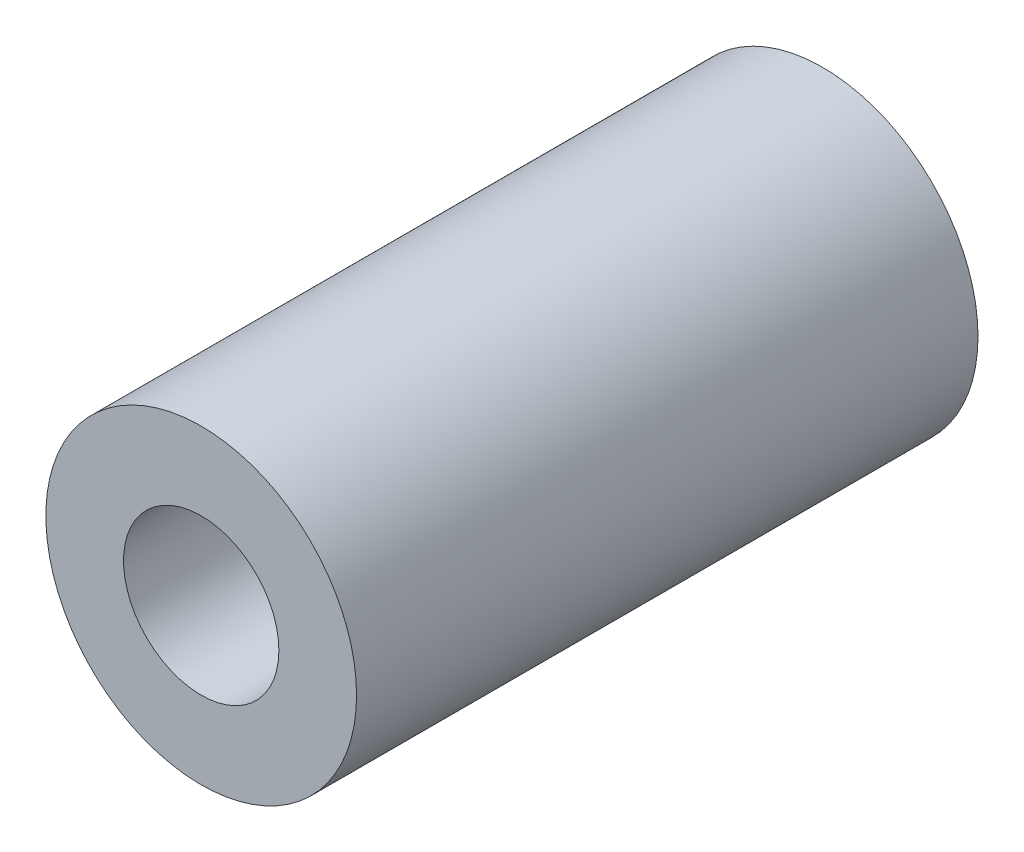
ISO-10303-21;
HEADER;
FILE_DESCRIPTION(('STEP AP214'),'2;1');
FILE_NAME('part.step','',(''),(''),'','','');
FILE_SCHEMA(('AUTOMOTIVE_DESIGN { 1 0 10303 214 1 1 1 1 }'));
ENDSEC;
DATA;
#1=APPLICATION_CONTEXT('core data for automotive mechanical design processes');
#2=APPLICATION_PROTOCOL_DEFINITION('international standard','automotive_design',2000,#1);
#3=PRODUCT_CONTEXT('',#1,'mechanical');
#4=PRODUCT('Part','Part','',(#3));
#5=PRODUCT_RELATED_PRODUCT_CATEGORY('part','',(#4));
#6=PRODUCT_DEFINITION_FORMATION('','',#4);
#7=PRODUCT_DEFINITION_CONTEXT('part definition',#1,'design');
#8=PRODUCT_DEFINITION('design','',#6,#7);
#9=PRODUCT_DEFINITION_SHAPE('','',#8);
#10=(LENGTH_UNIT() NAMED_UNIT(*) SI_UNIT(.MILLI.,.METRE.));
#11=(NAMED_UNIT(*) PLANE_ANGLE_UNIT() SI_UNIT($,.RADIAN.));
#12=(NAMED_UNIT(*) SI_UNIT($,.STERADIAN.) SOLID_ANGLE_UNIT());
#13=UNCERTAINTY_MEASURE_WITH_UNIT(LENGTH_MEASURE(1.E-05),#10,'distance_accuracy_value','');
#14=(GEOMETRIC_REPRESENTATION_CONTEXT(3) GLOBAL_UNCERTAINTY_ASSIGNED_CONTEXT((#13)) GLOBAL_UNIT_ASSIGNED_CONTEXT((#10,
#11,#12)) REPRESENTATION_CONTEXT('',''));
#15=CARTESIAN_POINT('',(0.,0.,0.));
#16=DIRECTION('',(0.,0.,1.));
#17=DIRECTION('',(1.,0.,0.));
#18=AXIS2_PLACEMENT_3D('',#15,#16,#17);
#19=CARTESIAN_POINT('',(0.,0.,12.7));
#20=DIRECTION('',(0.,0.,1.));
#21=DIRECTION('',(1.,0.,0.));
#22=AXIS2_PLACEMENT_3D('',#19,#20,#21);
#23=PLANE('',#22);
#24=CARTESIAN_POINT('',(0.,0.,12.7));
#25=DIRECTION('',(0.,0.,1.));
#26=DIRECTION('',(1.,0.,0.));
#27=AXIS2_PLACEMENT_3D('',#24,#25,#26);
#28=CIRCLE('',#27,3.175);
#29=CARTESIAN_POINT('',(3.175,0.,12.7));
#30=VERTEX_POINT('',#29);
#31=EDGE_CURVE('E10',#30,#30,#28,.T.);
#32=ORIENTED_EDGE('',*,*,#31,.T.);
#33=EDGE_LOOP('',(#32));
#34=FACE_BOUND('',#33,.T.);
#35=CARTESIAN_POINT('',(0.,0.,12.7));
#36=DIRECTION('',(0.,0.,1.));
#37=DIRECTION('',(1.,0.,0.));
#38=AXIS2_PLACEMENT_3D('',#35,#36,#37);
#39=CIRCLE('',#38,1.5875);
#40=CARTESIAN_POINT('',(1.5875,0.,12.7));
#41=VERTEX_POINT('',#40);
#42=EDGE_CURVE('E42',#41,#41,#39,.T.);
#43=ORIENTED_EDGE('',*,*,#42,.F.);
#44=EDGE_LOOP('',(#43));
#45=FACE_BOUND('',#44,.T.);
#46=ADVANCED_FACE('F31',(#34,#45),#23,.T.);
#47=CARTESIAN_POINT('',(0.,0.,0.));
#48=DIRECTION('',(0.,0.,1.));
#49=DIRECTION('',(1.,0.,0.));
#50=AXIS2_PLACEMENT_3D('',#47,#48,#49);
#51=PLANE('',#50);
#52=CARTESIAN_POINT('',(0.,0.,0.));
#53=DIRECTION('',(0.,0.,1.));
#54=DIRECTION('',(1.,0.,0.));
#55=AXIS2_PLACEMENT_3D('',#52,#53,#54);
#56=CIRCLE('',#55,3.175);
#57=CARTESIAN_POINT('',(3.175,0.,0.));
#58=VERTEX_POINT('',#57);
#59=EDGE_CURVE('E35',#58,#58,#56,.T.);
#60=ORIENTED_EDGE('',*,*,#59,.F.);
#61=EDGE_LOOP('',(#60));
#62=FACE_BOUND('',#61,.T.);
#63=CARTESIAN_POINT('',(0.,0.,0.));
#64=DIRECTION('',(0.,0.,1.));
#65=DIRECTION('',(1.,0.,0.));
#66=AXIS2_PLACEMENT_3D('',#63,#64,#65);
#67=CIRCLE('',#66,1.5875);
#68=CARTESIAN_POINT('',(1.5875,0.,0.));
#69=VERTEX_POINT('',#68);
#70=EDGE_CURVE('E44',#69,#69,#67,.T.);
#71=ORIENTED_EDGE('',*,*,#70,.T.);
#72=EDGE_LOOP('',(#71));
#73=FACE_BOUND('',#72,.T.);
#74=ADVANCED_FACE('F54',(#62,#73),#51,.F.);
#75=CARTESIAN_POINT('',(0.,0.,12.7));
#76=DIRECTION('',(0.,0.,-1.));
#77=DIRECTION('',(-1.,0.,0.));
#78=AXIS2_PLACEMENT_3D('',#75,#76,#77);
#79=CYLINDRICAL_SURFACE('',#78,3.175);
#80=ORIENTED_EDGE('',*,*,#31,.F.);
#81=EDGE_LOOP('',(#80));
#82=FACE_BOUND('',#81,.T.);
#83=ORIENTED_EDGE('',*,*,#59,.T.);
#84=EDGE_LOOP('',(#83));
#85=FACE_BOUND('',#84,.T.);
#86=ADVANCED_FACE('F33',(#82,#85),#79,.T.);
#87=CARTESIAN_POINT('',(0.,0.,12.7));
#88=DIRECTION('',(0.,0.,-1.));
#89=DIRECTION('',(-1.,0.,0.));
#90=AXIS2_PLACEMENT_3D('',#87,#88,#89);
#91=CYLINDRICAL_SURFACE('',#90,1.5875);
#92=ORIENTED_EDGE('',*,*,#42,.T.);
#93=EDGE_LOOP('',(#92));
#94=FACE_BOUND('',#93,.T.);
#95=ORIENTED_EDGE('',*,*,#70,.F.);
#96=EDGE_LOOP('',(#95));
#97=FACE_BOUND('',#96,.T.);
#98=ADVANCED_FACE('F50',(#94,#97),#91,.F.);
#99=CLOSED_SHELL('',(#46,#74,#86,#98));
#100=MANIFOLD_SOLID_BREP('B2',#99);
#101=ADVANCED_BREP_SHAPE_REPRESENTATION('',(#18,#100),#14);
#102=SHAPE_DEFINITION_REPRESENTATION(#9,#101);
ENDSEC;
END-ISO-10303-21;
